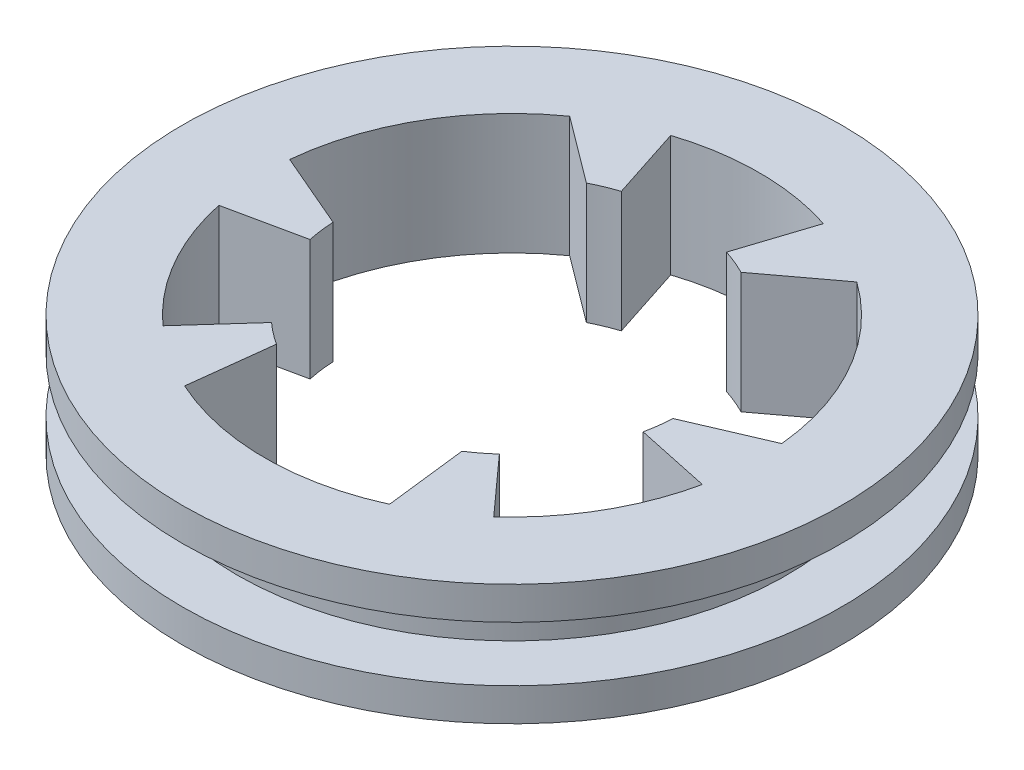
ISO-10303-21;
HEADER;
FILE_DESCRIPTION(('STEP AP214'),'2;1');
FILE_NAME('part.step','',(''),(''),'','','');
FILE_SCHEMA(('AUTOMOTIVE_DESIGN { 1 0 10303 214 1 1 1 1 }'));
ENDSEC;
DATA;
#1=APPLICATION_CONTEXT('core data for automotive mechanical design processes');
#2=APPLICATION_PROTOCOL_DEFINITION('international standard','automotive_design',2000,#1);
#3=PRODUCT_CONTEXT('',#1,'mechanical');
#4=PRODUCT('Part','Part','',(#3));
#5=PRODUCT_RELATED_PRODUCT_CATEGORY('part','',(#4));
#6=PRODUCT_DEFINITION_FORMATION('','',#4);
#7=PRODUCT_DEFINITION_CONTEXT('part definition',#1,'design');
#8=PRODUCT_DEFINITION('design','',#6,#7);
#9=PRODUCT_DEFINITION_SHAPE('','',#8);
#10=(LENGTH_UNIT() NAMED_UNIT(*) SI_UNIT(.MILLI.,.METRE.));
#11=(NAMED_UNIT(*) PLANE_ANGLE_UNIT() SI_UNIT($,.RADIAN.));
#12=(NAMED_UNIT(*) SI_UNIT($,.STERADIAN.) SOLID_ANGLE_UNIT());
#13=UNCERTAINTY_MEASURE_WITH_UNIT(LENGTH_MEASURE(1.E-05),#10,'distance_accuracy_value','');
#14=(GEOMETRIC_REPRESENTATION_CONTEXT(3) GLOBAL_UNCERTAINTY_ASSIGNED_CONTEXT((#13)) GLOBAL_UNIT_ASSIGNED_CONTEXT((#10,
#11,#12)) REPRESENTATION_CONTEXT('',''));
#15=CARTESIAN_POINT('',(0.,0.,0.));
#16=DIRECTION('',(0.,0.,1.));
#17=DIRECTION('',(1.,0.,0.));
#18=AXIS2_PLACEMENT_3D('',#15,#16,#17);
#19=CARTESIAN_POINT('',(-25.,2.5,0.));
#20=DIRECTION('',(0.,-1.,0.));
#21=DIRECTION('',(0.,0.,-1.));
#22=AXIS2_PLACEMENT_3D('',#19,#20,#21);
#23=PLANE('',#22);
#24=CARTESIAN_POINT('',(0.,2.5,0.));
#25=DIRECTION('',(0.,1.,0.));
#26=DIRECTION('',(0.,0.,1.));
#27=AXIS2_PLACEMENT_3D('',#24,#25,#26);
#28=CIRCLE('',#27,25.);
#29=CARTESIAN_POINT('',(0.,2.5,25.));
#30=VERTEX_POINT('',#29);
#31=EDGE_CURVE('E206',#30,#30,#28,.T.);
#32=ORIENTED_EDGE('',*,*,#31,.T.);
#33=EDGE_LOOP('',(#32));
#34=FACE_BOUND('',#33,.T.);
#35=CARTESIAN_POINT('',(0.,2.5,0.));
#36=DIRECTION('',(0.,1.,0.));
#37=DIRECTION('',(0.,0.,1.));
#38=AXIS2_PLACEMENT_3D('',#35,#36,#37);
#39=CIRCLE('',#38,30.);
#40=CARTESIAN_POINT('',(0.,2.5,30.));
#41=VERTEX_POINT('',#40);
#42=EDGE_CURVE('E11',#41,#41,#39,.T.);
#43=ORIENTED_EDGE('',*,*,#42,.F.);
#44=EDGE_LOOP('',(#43));
#45=FACE_BOUND('',#44,.T.);
#46=ADVANCED_FACE('F38',(#34,#45),#23,.T.);
#47=CARTESIAN_POINT('',(0.,19.9874111465534,0.));
#48=DIRECTION('',(0.,1.,0.));
#49=DIRECTION('',(0.,0.,1.));
#50=AXIS2_PLACEMENT_3D('',#47,#48,#49);
#51=CYLINDRICAL_SURFACE('',#50,30.);
#52=ORIENTED_EDGE('',*,*,#42,.T.);
#53=EDGE_LOOP('',(#52));
#54=FACE_BOUND('',#53,.T.);
#55=CARTESIAN_POINT('',(0.,5.5,0.));
#56=DIRECTION('',(0.,1.,0.));
#57=DIRECTION('',(0.,0.,1.));
#58=AXIS2_PLACEMENT_3D('',#55,#56,#57);
#59=CIRCLE('',#58,30.);
#60=CARTESIAN_POINT('',(0.,5.5,30.));
#61=VERTEX_POINT('',#60);
#62=EDGE_CURVE('E46',#61,#61,#59,.T.);
#63=ORIENTED_EDGE('',*,*,#62,.F.);
#64=EDGE_LOOP('',(#63));
#65=FACE_BOUND('',#64,.T.);
#66=ADVANCED_FACE('F391',(#54,#65),#51,.T.);
#67=CARTESIAN_POINT('',(-30.,5.5,0.));
#68=DIRECTION('',(0.,1.,0.));
#69=DIRECTION('',(0.,0.,1.));
#70=AXIS2_PLACEMENT_3D('',#67,#68,#69);
#71=PLANE('',#70);
#72=CARTESIAN_POINT('',(0.,5.5,0.));
#73=DIRECTION('',(0.,1.,0.));
#74=DIRECTION('',(0.,0.,1.));
#75=AXIS2_PLACEMENT_3D('',#72,#73,#74);
#76=CIRCLE('',#75,22.5);
#77=CARTESIAN_POINT('',(15.0554386430742,5.5,16.7207585732415));
#78=VERTEX_POINT('',#77);
#79=CARTESIAN_POINT('',(22.0083210165106,5.5,4.67801304339967));
#80=VERTEX_POINT('',#79);
#81=EDGE_CURVE('E53',#78,#80,#76,.T.);
#82=ORIENTED_EDGE('',*,*,#81,.F.);
#83=DIRECTION('',(-0.669130606358854,0.,-0.743144825477398));
#84=VECTOR('',#83,1.);
#85=CARTESIAN_POINT('',(0.,5.5,0.));
#86=LINE('',#85,#84);
#87=CARTESIAN_POINT('',(10.3715243985622,5.5,11.5187447948997));
#88=VERTEX_POINT('',#87);
#89=EDGE_CURVE('E213',#78,#88,#86,.T.);
#90=ORIENTED_EDGE('',*,*,#89,.T.);
#91=CARTESIAN_POINT('',(0.,5.5,0.));
#92=DIRECTION('',(0.,1.,0.));
#93=DIRECTION('',(0.,0.,1.));
#94=AXIS2_PLACEMENT_3D('',#91,#92,#93);
#95=CIRCLE('',#94,15.5);
#96=CARTESIAN_POINT('',(8.44097150806688,5.5,13.0000000000001));
#97=VERTEX_POINT('',#96);
#98=EDGE_CURVE('E237',#97,#88,#95,.T.);
#99=ORIENTED_EDGE('',*,*,#98,.F.);
#100=DIRECTION('',(0.117647058823515,0.,0.993055471537304));
#101=VECTOR('',#100,1.);
#102=CARTESIAN_POINT('',(6.8053507314174,5.5,-0.806228373702324));
#103=LINE('',#102,#101);
#104=CARTESIAN_POINT('',(9.32664330164017,5.5,20.4759303750518));
#105=VERTEX_POINT('',#104);
#106=EDGE_CURVE('E297',#97,#105,#103,.T.);
#107=ORIENTED_EDGE('',*,*,#106,.T.);
#108=CARTESIAN_POINT('',(0.,5.5,0.));
#109=DIRECTION('',(0.,1.,0.));
#110=DIRECTION('',(0.,0.,1.));
#111=AXIS2_PLACEMENT_3D('',#108,#109,#110);
#112=CIRCLE('',#111,22.5);
#113=CARTESIAN_POINT('',(-9.32664330164046,5.5,20.4759303750517));
#114=VERTEX_POINT('',#113);
#115=EDGE_CURVE('E293',#114,#105,#112,.T.);
#116=ORIENTED_EDGE('',*,*,#115,.F.);
#117=DIRECTION('',(-0.117647058823529,0.,0.993055471537302));
#118=VECTOR('',#117,1.);
#119=CARTESIAN_POINT('',(-6.80535073141739,5.5,-0.806228373702421));
#120=LINE('',#119,#118);
#121=CARTESIAN_POINT('',(-8.44097150806707,5.5,13.));
#122=VERTEX_POINT('',#121);
#123=EDGE_CURVE('E289',#122,#114,#120,.T.);
#124=ORIENTED_EDGE('',*,*,#123,.F.);
#125=CARTESIAN_POINT('',(-10.3715243985624,5.5,11.5187447948995));
#126=VERTEX_POINT('',#125);
#127=EDGE_CURVE('E288',#126,#122,#95,.T.);
#128=ORIENTED_EDGE('',*,*,#127,.F.);
#129=DIRECTION('',(0.669130606358865,0.,-0.743144825477388));
#130=VECTOR('',#129,1.);
#131=CARTESIAN_POINT('',(0.,5.5,0.));
#132=LINE('',#131,#130);
#133=CARTESIAN_POINT('',(-15.0554386430745,5.5,16.7207585732412));
#134=VERTEX_POINT('',#133);
#135=EDGE_CURVE('E284',#134,#126,#132,.T.);
#136=ORIENTED_EDGE('',*,*,#135,.F.);
#137=CARTESIAN_POINT('',(0.,5.5,0.));
#138=DIRECTION('',(0.,1.,0.));
#139=DIRECTION('',(0.,0.,1.));
#140=AXIS2_PLACEMENT_3D('',#137,#138,#139);
#141=CIRCLE('',#140,22.5);
#142=CARTESIAN_POINT('',(-22.0083210165107,5.5,4.67801304339936));
#143=VERTEX_POINT('',#142);
#144=EDGE_CURVE('E280',#143,#134,#141,.T.);
#145=ORIENTED_EDGE('',*,*,#144,.F.);
#146=DIRECTION('',(0.978147600733808,0.,-0.20791169081775));
#147=VECTOR('',#146,1.);
#148=CARTESIAN_POINT('',(0.,5.5,0.));
#149=LINE('',#148,#147);
#150=CARTESIAN_POINT('',(-15.161287811374,5.5,3.22263120767511));
#151=VERTEX_POINT('',#150);
#152=EDGE_CURVE('E276',#143,#151,#149,.T.);
#153=ORIENTED_EDGE('',*,*,#152,.T.);
#154=CARTESIAN_POINT('',(-15.4788160032312,5.5,0.810095758606647));
#155=VERTEX_POINT('',#154);
#156=EDGE_CURVE('E275',#155,#151,#95,.T.);
#157=ORIENTED_EDGE('',*,*,#156,.F.);
#158=DIRECTION('',(-0.918834795130201,0.,-0.394642394146957));
#159=VECTOR('',#158,1.);
#160=CARTESIAN_POINT('',(-2.70446111283062,5.5,6.29672080192167));
#161=LINE('',#160,#159);
#162=CARTESIAN_POINT('',(-22.3959975217364,5.5,-2.16085515626935));
#163=VERTEX_POINT('',#162);
#164=EDGE_CURVE('E271',#155,#163,#161,.T.);
#165=ORIENTED_EDGE('',*,*,#164,.T.);
#166=CARTESIAN_POINT('',(0.,5.5,0.));
#167=DIRECTION('',(0.,1.,0.));
#168=DIRECTION('',(0.,0.,1.));
#169=AXIS2_PLACEMENT_3D('',#166,#167,#168);
#170=CIRCLE('',#169,22.5);
#171=CARTESIAN_POINT('',(-13.0693542200959,5.5,-18.3150752187825));
#172=VERTEX_POINT('',#171);
#173=EDGE_CURVE('E267',#172,#163,#170,.T.);
#174=ORIENTED_EDGE('',*,*,#173,.F.);
#175=DIRECTION('',(-0.801187736306671,0.,-0.598413077390353));
#176=VECTOR('',#175,1.);
#177=CARTESIAN_POINT('',(4.10088961858683,5.5,-5.49049242821924));
#178=LINE('',#177,#176);
#179=CARTESIAN_POINT('',(-7.03784449516411,5.5,-13.8100957586068));
#180=VERTEX_POINT('',#179);
#181=EDGE_CURVE('E263',#180,#172,#178,.T.);
#182=ORIENTED_EDGE('',*,*,#181,.F.);
#183=CARTESIAN_POINT('',(-4.78976341281149,5.5,-14.7413760025749));
#184=VERTEX_POINT('',#183);
#185=EDGE_CURVE('E262',#184,#180,#95,.T.);
#186=ORIENTED_EDGE('',*,*,#185,.F.);
#187=DIRECTION('',(0.309016994374935,0.,0.951056516295158));
#188=VECTOR('',#187,1.);
#189=CARTESIAN_POINT('',(0.,5.5,0.));
#190=LINE('',#189,#188);
#191=CARTESIAN_POINT('',(-6.95288237343603,5.5,-21.398771616641));
#192=VERTEX_POINT('',#191);
#193=EDGE_CURVE('E258',#192,#184,#190,.T.);
#194=ORIENTED_EDGE('',*,*,#193,.F.);
#195=CARTESIAN_POINT('',(0.,5.5,0.));
#196=DIRECTION('',(0.,1.,0.));
#197=DIRECTION('',(0.,0.,1.));
#198=AXIS2_PLACEMENT_3D('',#195,#196,#197);
#199=CIRCLE('',#198,22.5);
#200=CARTESIAN_POINT('',(6.95288237343663,5.5,-21.3987716166409));
#201=VERTEX_POINT('',#200);
#202=EDGE_CURVE('E254',#201,#192,#199,.T.);
#203=ORIENTED_EDGE('',*,*,#202,.F.);
#204=DIRECTION('',(-0.309016994374961,0.,0.951056516295149));
#205=VECTOR('',#204,1.);
#206=CARTESIAN_POINT('',(0.,5.5,0.));
#207=LINE('',#206,#205);
#208=CARTESIAN_POINT('',(4.78976341281191,5.5,-14.7413760025748));
#209=VERTEX_POINT('',#208);
#210=EDGE_CURVE('E250',#201,#209,#207,.T.);
#211=ORIENTED_EDGE('',*,*,#210,.T.);
#212=CARTESIAN_POINT('',(7.0378444951643,5.5,-13.8100957586067));
#213=VERTEX_POINT('',#212);
#214=EDGE_CURVE('E238',#213,#209,#95,.T.);
#215=ORIENTED_EDGE('',*,*,#214,.F.);
#216=DIRECTION('',(0.801187736306679,0.,-0.598413077390342));
#217=VECTOR('',#216,1.);
#218=CARTESIAN_POINT('',(-4.10088961858676,5.5,-5.49049242821931));
#219=LINE('',#218,#217);
#220=CARTESIAN_POINT('',(13.0693542200962,5.5,-18.3150752187823));
#221=VERTEX_POINT('',#220);
#222=EDGE_CURVE('E246',#213,#221,#219,.T.);
#223=ORIENTED_EDGE('',*,*,#222,.T.);
#224=CARTESIAN_POINT('',(0.,5.5,0.));
#225=DIRECTION('',(0.,1.,0.));
#226=DIRECTION('',(0.,0.,1.));
#227=AXIS2_PLACEMENT_3D('',#224,#225,#226);
#228=CIRCLE('',#227,22.5);
#229=CARTESIAN_POINT('',(22.3959975217365,5.5,-2.16085515626904));
#230=VERTEX_POINT('',#229);
#231=EDGE_CURVE('E242',#230,#221,#228,.T.);
#232=ORIENTED_EDGE('',*,*,#231,.F.);
#233=DIRECTION('',(0.918834795130206,0.,-0.394642394146944));
#234=VECTOR('',#233,1.);
#235=CARTESIAN_POINT('',(2.70446111283053,5.5,6.29672080192171));
#236=LINE('',#235,#234);
#237=CARTESIAN_POINT('',(15.4788160032312,5.5,0.810095758606862));
#238=VERTEX_POINT('',#237);
#239=EDGE_CURVE('E236',#238,#230,#236,.T.);
#240=ORIENTED_EDGE('',*,*,#239,.F.);
#241=CARTESIAN_POINT('',(15.161287811374,5.5,3.22263120767533));
#242=VERTEX_POINT('',#241);
#243=EDGE_CURVE('E232',#242,#238,#95,.T.);
#244=ORIENTED_EDGE('',*,*,#243,.F.);
#245=DIRECTION('',(-0.978147600733805,0.,-0.207911690817763));
#246=VECTOR('',#245,1.);
#247=CARTESIAN_POINT('',(0.,5.5,0.));
#248=LINE('',#247,#246);
#249=EDGE_CURVE('E224',#80,#242,#248,.T.);
#250=ORIENTED_EDGE('',*,*,#249,.F.);
#251=EDGE_LOOP('',(#82,#90,#99,#107,#116,#124,#128,#136,#145,#153,#157,#165,#174,#182,#186,#194,
#203,#211,#215,#223,#232,#240,#244,#250));
#252=FACE_BOUND('',#251,.T.);
#253=ORIENTED_EDGE('',*,*,#62,.T.);
#254=EDGE_LOOP('',(#253));
#255=FACE_BOUND('',#254,.T.);
#256=ADVANCED_FACE('F389',(#252,#255),#71,.T.);
#257=CARTESIAN_POINT('',(-30.,-5.5,0.));
#258=DIRECTION('',(0.,-1.,0.));
#259=DIRECTION('',(0.,0.,-1.));
#260=AXIS2_PLACEMENT_3D('',#257,#258,#259);
#261=PLANE('',#260);
#262=CARTESIAN_POINT('',(0.,-5.5,0.));
#263=DIRECTION('',(0.,-1.,0.));
#264=DIRECTION('',(0.,0.,-1.));
#265=AXIS2_PLACEMENT_3D('',#262,#263,#264);
#266=CIRCLE('',#265,22.5);
#267=CARTESIAN_POINT('',(15.0554386430742,-5.5,16.7207585732415));
#268=VERTEX_POINT('',#267);
#269=CARTESIAN_POINT('',(22.0083210165106,-5.5,4.67801304339967));
#270=VERTEX_POINT('',#269);
#271=EDGE_CURVE('E210',#268,#270,#266,.F.);
#272=ORIENTED_EDGE('',*,*,#271,.T.);
#273=DIRECTION('',(-0.978147600733805,0.,-0.207911690817763));
#274=VECTOR('',#273,1.);
#275=CARTESIAN_POINT('',(0.,-5.5,0.));
#276=LINE('',#275,#274);
#277=CARTESIAN_POINT('',(15.161287811374,-5.5,3.22263120767533));
#278=VERTEX_POINT('',#277);
#279=EDGE_CURVE('E198',#270,#278,#276,.T.);
#280=ORIENTED_EDGE('',*,*,#279,.T.);
#281=CARTESIAN_POINT('',(0.,-5.5,0.));
#282=DIRECTION('',(0.,-1.,0.));
#283=DIRECTION('',(0.,0.,-1.));
#284=AXIS2_PLACEMENT_3D('',#281,#282,#283);
#285=CIRCLE('',#284,15.5);
#286=CARTESIAN_POINT('',(15.4788160032312,-5.5,0.810095758606862));
#287=VERTEX_POINT('',#286);
#288=EDGE_CURVE('E574',#278,#287,#285,.F.);
#289=ORIENTED_EDGE('',*,*,#288,.T.);
#290=DIRECTION('',(0.918834795130206,0.,-0.394642394146944));
#291=VECTOR('',#290,1.);
#292=CARTESIAN_POINT('',(2.70446111283053,-5.5,6.29672080192171));
#293=LINE('',#292,#291);
#294=CARTESIAN_POINT('',(22.3959975217365,-5.5,-2.16085515626904));
#295=VERTEX_POINT('',#294);
#296=EDGE_CURVE('E570',#287,#295,#293,.T.);
#297=ORIENTED_EDGE('',*,*,#296,.T.);
#298=CARTESIAN_POINT('',(0.,-5.5,0.));
#299=DIRECTION('',(0.,-1.,0.));
#300=DIRECTION('',(0.,0.,-1.));
#301=AXIS2_PLACEMENT_3D('',#298,#299,#300);
#302=CIRCLE('',#301,22.5);
#303=CARTESIAN_POINT('',(13.0693542200961,-5.5,-18.3150752187823));
#304=VERTEX_POINT('',#303);
#305=EDGE_CURVE('E566',#295,#304,#302,.F.);
#306=ORIENTED_EDGE('',*,*,#305,.T.);
#307=DIRECTION('',(0.801187736306679,0.,-0.598413077390342));
#308=VECTOR('',#307,1.);
#309=CARTESIAN_POINT('',(-4.10088961858676,-5.5,-5.49049242821931));
#310=LINE('',#309,#308);
#311=CARTESIAN_POINT('',(7.0378444951643,-5.5,-13.8100957586067));
#312=VERTEX_POINT('',#311);
#313=EDGE_CURVE('E563',#312,#304,#310,.T.);
#314=ORIENTED_EDGE('',*,*,#313,.F.);
#315=CARTESIAN_POINT('',(0.,-5.5,0.));
#316=DIRECTION('',(0.,-1.,0.));
#317=DIRECTION('',(0.,0.,-1.));
#318=AXIS2_PLACEMENT_3D('',#315,#316,#317);
#319=CIRCLE('',#318,15.5);
#320=CARTESIAN_POINT('',(4.78976341281191,-5.5,-14.7413760025748));
#321=VERTEX_POINT('',#320);
#322=EDGE_CURVE('E559',#312,#321,#319,.F.);
#323=ORIENTED_EDGE('',*,*,#322,.T.);
#324=DIRECTION('',(-0.309016994374961,0.,0.951056516295149));
#325=VECTOR('',#324,1.);
#326=CARTESIAN_POINT('',(0.,-5.5,0.));
#327=LINE('',#326,#325);
#328=CARTESIAN_POINT('',(6.95288237343663,-5.5,-21.3987716166409));
#329=VERTEX_POINT('',#328);
#330=EDGE_CURVE('E556',#329,#321,#327,.T.);
#331=ORIENTED_EDGE('',*,*,#330,.F.);
#332=CARTESIAN_POINT('',(0.,-5.5,0.));
#333=DIRECTION('',(0.,-1.,0.));
#334=DIRECTION('',(0.,0.,-1.));
#335=AXIS2_PLACEMENT_3D('',#332,#333,#334);
#336=CIRCLE('',#335,22.5);
#337=CARTESIAN_POINT('',(-6.95288237343603,-5.5,-21.3987716166411));
#338=VERTEX_POINT('',#337);
#339=EDGE_CURVE('E552',#329,#338,#336,.F.);
#340=ORIENTED_EDGE('',*,*,#339,.T.);
#341=DIRECTION('',(0.309016994374935,0.,0.951056516295158));
#342=VECTOR('',#341,1.);
#343=CARTESIAN_POINT('',(0.,-5.5,0.));
#344=LINE('',#343,#342);
#345=CARTESIAN_POINT('',(-4.78976341281149,-5.5,-14.7413760025749));
#346=VERTEX_POINT('',#345);
#347=EDGE_CURVE('E548',#338,#346,#344,.T.);
#348=ORIENTED_EDGE('',*,*,#347,.T.);
#349=CARTESIAN_POINT('',(0.,-5.5,0.));
#350=DIRECTION('',(0.,-1.,0.));
#351=DIRECTION('',(0.,0.,-1.));
#352=AXIS2_PLACEMENT_3D('',#349,#350,#351);
#353=CIRCLE('',#352,15.5);
#354=CARTESIAN_POINT('',(-7.03784449516411,-5.5,-13.8100957586068));
#355=VERTEX_POINT('',#354);
#356=EDGE_CURVE('E544',#346,#355,#353,.F.);
#357=ORIENTED_EDGE('',*,*,#356,.T.);
#358=DIRECTION('',(-0.801187736306671,0.,-0.598413077390353));
#359=VECTOR('',#358,1.);
#360=CARTESIAN_POINT('',(4.10088961858683,-5.5,-5.49049242821924));
#361=LINE('',#360,#359);
#362=CARTESIAN_POINT('',(-13.0693542200959,-5.5,-18.3150752187825));
#363=VERTEX_POINT('',#362);
#364=EDGE_CURVE('E540',#355,#363,#361,.T.);
#365=ORIENTED_EDGE('',*,*,#364,.T.);
#366=CARTESIAN_POINT('',(0.,-5.5,0.));
#367=DIRECTION('',(0.,-1.,0.));
#368=DIRECTION('',(0.,0.,-1.));
#369=AXIS2_PLACEMENT_3D('',#366,#367,#368);
#370=CIRCLE('',#369,22.5);
#371=CARTESIAN_POINT('',(-22.3959975217364,-5.5,-2.16085515626935));
#372=VERTEX_POINT('',#371);
#373=EDGE_CURVE('E536',#363,#372,#370,.F.);
#374=ORIENTED_EDGE('',*,*,#373,.T.);
#375=DIRECTION('',(-0.918834795130201,0.,-0.394642394146957));
#376=VECTOR('',#375,1.);
#377=CARTESIAN_POINT('',(-2.70446111283062,-5.5,6.29672080192167));
#378=LINE('',#377,#376);
#379=CARTESIAN_POINT('',(-15.4788160032312,-5.5,0.810095758606648));
#380=VERTEX_POINT('',#379);
#381=EDGE_CURVE('E533',#380,#372,#378,.T.);
#382=ORIENTED_EDGE('',*,*,#381,.F.);
#383=CARTESIAN_POINT('',(0.,-5.5,0.));
#384=DIRECTION('',(0.,-1.,0.));
#385=DIRECTION('',(0.,0.,-1.));
#386=AXIS2_PLACEMENT_3D('',#383,#384,#385);
#387=CIRCLE('',#386,15.5);
#388=CARTESIAN_POINT('',(-15.161287811374,-5.5,3.22263120767511));
#389=VERTEX_POINT('',#388);
#390=EDGE_CURVE('E529',#380,#389,#387,.F.);
#391=ORIENTED_EDGE('',*,*,#390,.T.);
#392=DIRECTION('',(0.978147600733808,0.,-0.20791169081775));
#393=VECTOR('',#392,1.);
#394=CARTESIAN_POINT('',(0.,-5.5,0.));
#395=LINE('',#394,#393);
#396=CARTESIAN_POINT('',(-22.0083210165107,-5.5,4.67801304339936));
#397=VERTEX_POINT('',#396);
#398=EDGE_CURVE('E526',#397,#389,#395,.T.);
#399=ORIENTED_EDGE('',*,*,#398,.F.);
#400=CARTESIAN_POINT('',(0.,-5.5,0.));
#401=DIRECTION('',(0.,-1.,0.));
#402=DIRECTION('',(0.,0.,-1.));
#403=AXIS2_PLACEMENT_3D('',#400,#401,#402);
#404=CIRCLE('',#403,22.5);
#405=CARTESIAN_POINT('',(-15.0554386430745,-5.5,16.7207585732412));
#406=VERTEX_POINT('',#405);
#407=EDGE_CURVE('E522',#397,#406,#404,.F.);
#408=ORIENTED_EDGE('',*,*,#407,.T.);
#409=DIRECTION('',(0.669130606358865,0.,-0.743144825477388));
#410=VECTOR('',#409,1.);
#411=CARTESIAN_POINT('',(0.,-5.5,0.));
#412=LINE('',#411,#410);
#413=CARTESIAN_POINT('',(-10.3715243985624,-5.5,11.5187447948995));
#414=VERTEX_POINT('',#413);
#415=EDGE_CURVE('E518',#406,#414,#412,.T.);
#416=ORIENTED_EDGE('',*,*,#415,.T.);
#417=CARTESIAN_POINT('',(0.,-5.5,0.));
#418=DIRECTION('',(0.,-1.,0.));
#419=DIRECTION('',(0.,0.,-1.));
#420=AXIS2_PLACEMENT_3D('',#417,#418,#419);
#421=CIRCLE('',#420,15.5);
#422=CARTESIAN_POINT('',(-8.44097150806707,-5.5,13.));
#423=VERTEX_POINT('',#422);
#424=EDGE_CURVE('E514',#414,#423,#421,.F.);
#425=ORIENTED_EDGE('',*,*,#424,.T.);
#426=DIRECTION('',(-0.117647058823529,0.,0.993055471537302));
#427=VECTOR('',#426,1.);
#428=CARTESIAN_POINT('',(-6.80535073141739,-5.5,-0.806228373702421));
#429=LINE('',#428,#427);
#430=CARTESIAN_POINT('',(-9.32664330164046,-5.5,20.4759303750517));
#431=VERTEX_POINT('',#430);
#432=EDGE_CURVE('E510',#423,#431,#429,.T.);
#433=ORIENTED_EDGE('',*,*,#432,.T.);
#434=CARTESIAN_POINT('',(0.,-5.5,0.));
#435=DIRECTION('',(0.,-1.,0.));
#436=DIRECTION('',(0.,0.,-1.));
#437=AXIS2_PLACEMENT_3D('',#434,#435,#436);
#438=CIRCLE('',#437,22.5);
#439=CARTESIAN_POINT('',(9.32664330164017,-5.5,20.4759303750518));
#440=VERTEX_POINT('',#439);
#441=EDGE_CURVE('E505',#431,#440,#438,.F.);
#442=ORIENTED_EDGE('',*,*,#441,.T.);
#443=DIRECTION('',(0.117647058823515,0.,0.993055471537304));
#444=VECTOR('',#443,1.);
#445=CARTESIAN_POINT('',(6.8053507314174,-5.5,-0.806228373702324));
#446=LINE('',#445,#444);
#447=CARTESIAN_POINT('',(8.44097150806688,-5.5,13.0000000000001));
#448=VERTEX_POINT('',#447);
#449=EDGE_CURVE('E502',#448,#440,#446,.T.);
#450=ORIENTED_EDGE('',*,*,#449,.F.);
#451=CARTESIAN_POINT('',(0.,-5.5,0.));
#452=DIRECTION('',(0.,-1.,0.));
#453=DIRECTION('',(0.,0.,-1.));
#454=AXIS2_PLACEMENT_3D('',#451,#452,#453);
#455=CIRCLE('',#454,15.5);
#456=CARTESIAN_POINT('',(10.3715243985622,-5.5,11.5187447948997));
#457=VERTEX_POINT('',#456);
#458=EDGE_CURVE('E226',#448,#457,#455,.F.);
#459=ORIENTED_EDGE('',*,*,#458,.T.);
#460=DIRECTION('',(-0.669130606358854,0.,-0.743144825477398));
#461=VECTOR('',#460,1.);
#462=CARTESIAN_POINT('',(0.,-5.5,0.));
#463=LINE('',#462,#461);
#464=EDGE_CURVE('E219',#268,#457,#463,.T.);
#465=ORIENTED_EDGE('',*,*,#464,.F.);
#466=EDGE_LOOP('',(#272,#280,#289,#297,#306,#314,#323,#331,#340,#348,#357,#365,#374,#382,#391,
#399,#408,#416,#425,#433,#442,#450,#459,#465));
#467=FACE_BOUND('',#466,.T.);
#468=CARTESIAN_POINT('',(0.,-5.5,0.));
#469=DIRECTION('',(0.,1.,0.));
#470=DIRECTION('',(0.,0.,1.));
#471=AXIS2_PLACEMENT_3D('',#468,#469,#470);
#472=CIRCLE('',#471,30.);
#473=CARTESIAN_POINT('',(0.,-5.5,30.));
#474=VERTEX_POINT('',#473);
#475=EDGE_CURVE('E382',#474,#474,#472,.T.);
#476=ORIENTED_EDGE('',*,*,#475,.F.);
#477=EDGE_LOOP('',(#476));
#478=FACE_BOUND('',#477,.T.);
#479=ADVANCED_FACE('F216',(#467,#478),#261,.T.);
#480=CARTESIAN_POINT('',(0.,19.9874111465534,0.));
#481=DIRECTION('',(0.,1.,0.));
#482=DIRECTION('',(0.,0.,1.));
#483=AXIS2_PLACEMENT_3D('',#480,#481,#482);
#484=CYLINDRICAL_SURFACE('',#483,30.);
#485=ORIENTED_EDGE('',*,*,#475,.T.);
#486=EDGE_LOOP('',(#485));
#487=FACE_BOUND('',#486,.T.);
#488=CARTESIAN_POINT('',(0.,-2.5,0.));
#489=DIRECTION('',(0.,1.,0.));
#490=DIRECTION('',(0.,0.,1.));
#491=AXIS2_PLACEMENT_3D('',#488,#489,#490);
#492=CIRCLE('',#491,30.);
#493=CARTESIAN_POINT('',(0.,-2.5,30.));
#494=VERTEX_POINT('',#493);
#495=EDGE_CURVE('E378',#494,#494,#492,.T.);
#496=ORIENTED_EDGE('',*,*,#495,.F.);
#497=EDGE_LOOP('',(#496));
#498=FACE_BOUND('',#497,.T.);
#499=ADVANCED_FACE('F405',(#487,#498),#484,.T.);
#500=CARTESIAN_POINT('',(-25.,-2.5,0.));
#501=DIRECTION('',(0.,1.,0.));
#502=DIRECTION('',(0.,0.,1.));
#503=AXIS2_PLACEMENT_3D('',#500,#501,#502);
#504=PLANE('',#503);
#505=ORIENTED_EDGE('',*,*,#495,.T.);
#506=EDGE_LOOP('',(#505));
#507=FACE_BOUND('',#506,.T.);
#508=CARTESIAN_POINT('',(0.,-2.5,0.));
#509=DIRECTION('',(0.,1.,0.));
#510=DIRECTION('',(0.,0.,1.));
#511=AXIS2_PLACEMENT_3D('',#508,#509,#510);
#512=CIRCLE('',#511,25.);
#513=CARTESIAN_POINT('',(0.,-2.5,25.));
#514=VERTEX_POINT('',#513);
#515=EDGE_CURVE('E374',#514,#514,#512,.T.);
#516=ORIENTED_EDGE('',*,*,#515,.F.);
#517=EDGE_LOOP('',(#516));
#518=FACE_BOUND('',#517,.T.);
#519=ADVANCED_FACE('F408',(#507,#518),#504,.T.);
#520=CARTESIAN_POINT('',(0.,19.9874111465534,0.));
#521=DIRECTION('',(0.,1.,0.));
#522=DIRECTION('',(0.,0.,1.));
#523=AXIS2_PLACEMENT_3D('',#520,#521,#522);
#524=CYLINDRICAL_SURFACE('',#523,25.);
#525=ORIENTED_EDGE('',*,*,#515,.T.);
#526=EDGE_LOOP('',(#525));
#527=FACE_BOUND('',#526,.T.);
#528=ORIENTED_EDGE('',*,*,#31,.F.);
#529=EDGE_LOOP('',(#528));
#530=FACE_BOUND('',#529,.T.);
#531=ADVANCED_FACE('F412',(#527,#530),#524,.T.);
#532=CARTESIAN_POINT('',(0.,-5.501,0.));
#533=DIRECTION('',(0.,1.,0.));
#534=DIRECTION('',(0.,0.,1.));
#535=AXIS2_PLACEMENT_3D('',#532,#533,#534);
#536=CYLINDRICAL_SURFACE('',#535,22.5);
#537=DIRECTION('',(0.,1.,0.));
#538=VECTOR('',#537,1.);
#539=CARTESIAN_POINT('',(15.0554386430742,-5.501,16.7207585732415));
#540=LINE('',#539,#538);
#541=EDGE_CURVE('E207',#268,#78,#540,.T.);
#542=ORIENTED_EDGE('',*,*,#541,.T.);
#543=ORIENTED_EDGE('',*,*,#81,.T.);
#544=DIRECTION('',(0.,1.,0.));
#545=VECTOR('',#544,1.);
#546=CARTESIAN_POINT('',(22.0083210165106,-5.501,4.67801304339967));
#547=LINE('',#546,#545);
#548=EDGE_CURVE('E200',#270,#80,#547,.T.);
#549=ORIENTED_EDGE('',*,*,#548,.F.);
#550=ORIENTED_EDGE('',*,*,#271,.F.);
#551=EDGE_LOOP('',(#542,#543,#549,#550));
#552=FACE_BOUND('',#551,.T.);
#553=ADVANCED_FACE('F209',(#552),#536,.F.);
#554=CARTESIAN_POINT('',(0.,-5.501,0.));
#555=DIRECTION('',(0.743144825477398,0.,-0.669130606358854));
#556=DIRECTION('',(-0.669130606358854,0.,-0.743144825477398));
#557=AXIS2_PLACEMENT_3D('',#554,#555,#556);
#558=PLANE('',#557);
#559=ORIENTED_EDGE('',*,*,#464,.T.);
#560=DIRECTION('',(0.,1.,0.));
#561=VECTOR('',#560,1.);
#562=CARTESIAN_POINT('',(10.3715243985622,-5.501,11.5187447948997));
#563=LINE('',#562,#561);
#564=EDGE_CURVE('E306',#457,#88,#563,.T.);
#565=ORIENTED_EDGE('',*,*,#564,.T.);
#566=ORIENTED_EDGE('',*,*,#89,.F.);
#567=ORIENTED_EDGE('',*,*,#541,.F.);
#568=EDGE_LOOP('',(#559,#565,#566,#567));
#569=FACE_BOUND('',#568,.T.);
#570=ADVANCED_FACE('F419',(#569),#558,.T.);
#571=CARTESIAN_POINT('',(0.,-5.501,0.));
#572=DIRECTION('',(0.,1.,0.));
#573=DIRECTION('',(0.,0.,1.));
#574=AXIS2_PLACEMENT_3D('',#571,#572,#573);
#575=CYLINDRICAL_SURFACE('',#574,15.5);
#576=DIRECTION('',(0.,1.,0.));
#577=VECTOR('',#576,1.);
#578=CARTESIAN_POINT('',(8.44097150806688,-5.501,13.0000000000001));
#579=LINE('',#578,#577);
#580=EDGE_CURVE('E309',#448,#97,#579,.T.);
#581=ORIENTED_EDGE('',*,*,#580,.T.);
#582=ORIENTED_EDGE('',*,*,#98,.T.);
#583=ORIENTED_EDGE('',*,*,#564,.F.);
#584=ORIENTED_EDGE('',*,*,#458,.F.);
#585=EDGE_LOOP('',(#581,#582,#583,#584));
#586=FACE_BOUND('',#585,.T.);
#587=ADVANCED_FACE('F486',(#586),#575,.F.);
#588=CARTESIAN_POINT('',(6.8053507314174,-5.501,-0.806228373702324));
#589=DIRECTION('',(-0.993055471537303,0.,0.117647058823515));
#590=DIRECTION('',(0.117647058823515,0.,0.993055471537304));
#591=AXIS2_PLACEMENT_3D('',#588,#589,#590);
#592=PLANE('',#591);
#593=ORIENTED_EDGE('',*,*,#449,.T.);
#594=DIRECTION('',(0.,1.,0.));
#595=VECTOR('',#594,1.);
#596=CARTESIAN_POINT('',(9.32664330164017,-5.501,20.4759303750518));
#597=LINE('',#596,#595);
#598=EDGE_CURVE('E312',#440,#105,#597,.T.);
#599=ORIENTED_EDGE('',*,*,#598,.T.);
#600=ORIENTED_EDGE('',*,*,#106,.F.);
#601=ORIENTED_EDGE('',*,*,#580,.F.);
#602=EDGE_LOOP('',(#593,#599,#600,#601));
#603=FACE_BOUND('',#602,.T.);
#604=ADVANCED_FACE('F482',(#603),#592,.T.);
#605=CARTESIAN_POINT('',(0.,-5.501,0.));
#606=DIRECTION('',(0.,1.,0.));
#607=DIRECTION('',(0.,0.,1.));
#608=AXIS2_PLACEMENT_3D('',#605,#606,#607);
#609=CYLINDRICAL_SURFACE('',#608,22.5);
#610=DIRECTION('',(0.,1.,0.));
#611=VECTOR('',#610,1.);
#612=CARTESIAN_POINT('',(-9.32664330164046,-5.501,20.4759303750517));
#613=LINE('',#612,#611);
#614=EDGE_CURVE('E315',#431,#114,#613,.T.);
#615=ORIENTED_EDGE('',*,*,#614,.T.);
#616=ORIENTED_EDGE('',*,*,#115,.T.);
#617=ORIENTED_EDGE('',*,*,#598,.F.);
#618=ORIENTED_EDGE('',*,*,#441,.F.);
#619=EDGE_LOOP('',(#615,#616,#617,#618));
#620=FACE_BOUND('',#619,.T.);
#621=ADVANCED_FACE('F478',(#620),#609,.F.);
#622=CARTESIAN_POINT('',(-6.80535073141739,-5.501,-0.806228373702421));
#623=DIRECTION('',(-0.993055471537302,0.,-0.117647058823529));
#624=DIRECTION('',(-0.117647058823529,0.,0.993055471537302));
#625=AXIS2_PLACEMENT_3D('',#622,#623,#624);
#626=PLANE('',#625);
#627=DIRECTION('',(0.,1.,0.));
#628=VECTOR('',#627,1.);
#629=CARTESIAN_POINT('',(-8.44097150806707,-5.501,13.));
#630=LINE('',#629,#628);
#631=EDGE_CURVE('E318',#423,#122,#630,.T.);
#632=ORIENTED_EDGE('',*,*,#631,.T.);
#633=ORIENTED_EDGE('',*,*,#123,.T.);
#634=ORIENTED_EDGE('',*,*,#614,.F.);
#635=ORIENTED_EDGE('',*,*,#432,.F.);
#636=EDGE_LOOP('',(#632,#633,#634,#635));
#637=FACE_BOUND('',#636,.T.);
#638=ADVANCED_FACE('F475',(#637),#626,.F.);
#639=DIRECTION('',(0.,1.,0.));
#640=VECTOR('',#639,1.);
#641=CARTESIAN_POINT('',(-10.3715243985624,-5.501,11.5187447948995));
#642=LINE('',#641,#640);
#643=EDGE_CURVE('E321',#414,#126,#642,.T.);
#644=ORIENTED_EDGE('',*,*,#643,.T.);
#645=ORIENTED_EDGE('',*,*,#127,.T.);
#646=ORIENTED_EDGE('',*,*,#631,.F.);
#647=ORIENTED_EDGE('',*,*,#424,.F.);
#648=EDGE_LOOP('',(#644,#645,#646,#647));
#649=FACE_BOUND('',#648,.T.);
#650=ADVANCED_FACE('F473',(#649),#575,.F.);
#651=CARTESIAN_POINT('',(0.,-5.501,0.));
#652=DIRECTION('',(0.743144825477388,0.,0.669130606358865));
#653=DIRECTION('',(0.669130606358865,0.,-0.743144825477388));
#654=AXIS2_PLACEMENT_3D('',#651,#652,#653);
#655=PLANE('',#654);
#656=DIRECTION('',(0.,1.,0.));
#657=VECTOR('',#656,1.);
#658=CARTESIAN_POINT('',(-15.0554386430745,-5.501,16.7207585732412));
#659=LINE('',#658,#657);
#660=EDGE_CURVE('E324',#406,#134,#659,.T.);
#661=ORIENTED_EDGE('',*,*,#660,.T.);
#662=ORIENTED_EDGE('',*,*,#135,.T.);
#663=ORIENTED_EDGE('',*,*,#643,.F.);
#664=ORIENTED_EDGE('',*,*,#415,.F.);
#665=EDGE_LOOP('',(#661,#662,#663,#664));
#666=FACE_BOUND('',#665,.T.);
#667=ADVANCED_FACE('F469',(#666),#655,.F.);
#668=CARTESIAN_POINT('',(0.,-5.501,0.));
#669=DIRECTION('',(0.,1.,0.));
#670=DIRECTION('',(0.,0.,1.));
#671=AXIS2_PLACEMENT_3D('',#668,#669,#670);
#672=CYLINDRICAL_SURFACE('',#671,22.5);
#673=DIRECTION('',(0.,1.,0.));
#674=VECTOR('',#673,1.);
#675=CARTESIAN_POINT('',(-22.0083210165107,-5.501,4.67801304339936));
#676=LINE('',#675,#674);
#677=EDGE_CURVE('E327',#397,#143,#676,.T.);
#678=ORIENTED_EDGE('',*,*,#677,.T.);
#679=ORIENTED_EDGE('',*,*,#144,.T.);
#680=ORIENTED_EDGE('',*,*,#660,.F.);
#681=ORIENTED_EDGE('',*,*,#407,.F.);
#682=EDGE_LOOP('',(#678,#679,#680,#681));
#683=FACE_BOUND('',#682,.T.);
#684=ADVANCED_FACE('F465',(#683),#672,.F.);
#685=CARTESIAN_POINT('',(0.,-5.501,0.));
#686=DIRECTION('',(0.20791169081775,0.,0.978147600733808));
#687=DIRECTION('',(0.978147600733808,0.,-0.20791169081775));
#688=AXIS2_PLACEMENT_3D('',#685,#686,#687);
#689=PLANE('',#688);
#690=ORIENTED_EDGE('',*,*,#398,.T.);
#691=DIRECTION('',(0.,1.,0.));
#692=VECTOR('',#691,1.);
#693=CARTESIAN_POINT('',(-15.161287811374,-5.501,3.22263120767511));
#694=LINE('',#693,#692);
#695=EDGE_CURVE('E330',#389,#151,#694,.T.);
#696=ORIENTED_EDGE('',*,*,#695,.T.);
#697=ORIENTED_EDGE('',*,*,#152,.F.);
#698=ORIENTED_EDGE('',*,*,#677,.F.);
#699=EDGE_LOOP('',(#690,#696,#697,#698));
#700=FACE_BOUND('',#699,.T.);
#701=ADVANCED_FACE('F462',(#700),#689,.T.);
#702=DIRECTION('',(0.,1.,0.));
#703=VECTOR('',#702,1.);
#704=CARTESIAN_POINT('',(-15.4788160032312,-5.501,0.810095758606647));
#705=LINE('',#704,#703);
#706=EDGE_CURVE('E333',#380,#155,#705,.T.);
#707=ORIENTED_EDGE('',*,*,#706,.T.);
#708=ORIENTED_EDGE('',*,*,#156,.T.);
#709=ORIENTED_EDGE('',*,*,#695,.F.);
#710=ORIENTED_EDGE('',*,*,#390,.F.);
#711=EDGE_LOOP('',(#707,#708,#709,#710));
#712=FACE_BOUND('',#711,.T.);
#713=ADVANCED_FACE('F460',(#712),#575,.F.);
#714=CARTESIAN_POINT('',(-2.70446111283062,-5.501,6.29672080192167));
#715=DIRECTION('',(0.394642394146957,0.,-0.918834795130201));
#716=DIRECTION('',(-0.918834795130201,0.,-0.394642394146957));
#717=AXIS2_PLACEMENT_3D('',#714,#715,#716);
#718=PLANE('',#717);
#719=ORIENTED_EDGE('',*,*,#381,.T.);
#720=DIRECTION('',(0.,1.,0.));
#721=VECTOR('',#720,1.);
#722=CARTESIAN_POINT('',(-22.3959975217364,-5.501,-2.16085515626935));
#723=LINE('',#722,#721);
#724=EDGE_CURVE('E336',#372,#163,#723,.T.);
#725=ORIENTED_EDGE('',*,*,#724,.T.);
#726=ORIENTED_EDGE('',*,*,#164,.F.);
#727=ORIENTED_EDGE('',*,*,#706,.F.);
#728=EDGE_LOOP('',(#719,#725,#726,#727));
#729=FACE_BOUND('',#728,.T.);
#730=ADVANCED_FACE('F456',(#729),#718,.T.);
#731=CARTESIAN_POINT('',(0.,-5.501,0.));
#732=DIRECTION('',(0.,1.,0.));
#733=DIRECTION('',(0.,0.,1.));
#734=AXIS2_PLACEMENT_3D('',#731,#732,#733);
#735=CYLINDRICAL_SURFACE('',#734,22.5);
#736=DIRECTION('',(0.,1.,0.));
#737=VECTOR('',#736,1.);
#738=CARTESIAN_POINT('',(-13.0693542200959,-5.501,-18.3150752187825));
#739=LINE('',#738,#737);
#740=EDGE_CURVE('E339',#363,#172,#739,.T.);
#741=ORIENTED_EDGE('',*,*,#740,.T.);
#742=ORIENTED_EDGE('',*,*,#173,.T.);
#743=ORIENTED_EDGE('',*,*,#724,.F.);
#744=ORIENTED_EDGE('',*,*,#373,.F.);
#745=EDGE_LOOP('',(#741,#742,#743,#744));
#746=FACE_BOUND('',#745,.T.);
#747=ADVANCED_FACE('F452',(#746),#735,.F.);
#748=CARTESIAN_POINT('',(4.10088961858683,-5.501,-5.49049242821924));
#749=DIRECTION('',(0.598413077390353,0.,-0.801187736306671));
#750=DIRECTION('',(-0.801187736306671,0.,-0.598413077390353));
#751=AXIS2_PLACEMENT_3D('',#748,#749,#750);
#752=PLANE('',#751);
#753=DIRECTION('',(0.,1.,0.));
#754=VECTOR('',#753,1.);
#755=CARTESIAN_POINT('',(-7.03784449516411,-5.501,-13.8100957586068));
#756=LINE('',#755,#754);
#757=EDGE_CURVE('E342',#355,#180,#756,.T.);
#758=ORIENTED_EDGE('',*,*,#757,.T.);
#759=ORIENTED_EDGE('',*,*,#181,.T.);
#760=ORIENTED_EDGE('',*,*,#740,.F.);
#761=ORIENTED_EDGE('',*,*,#364,.F.);
#762=EDGE_LOOP('',(#758,#759,#760,#761));
#763=FACE_BOUND('',#762,.T.);
#764=ADVANCED_FACE('F449',(#763),#752,.F.);
#765=DIRECTION('',(0.,1.,0.));
#766=VECTOR('',#765,1.);
#767=CARTESIAN_POINT('',(-4.78976341281149,-5.501,-14.7413760025749));
#768=LINE('',#767,#766);
#769=EDGE_CURVE('E345',#346,#184,#768,.T.);
#770=ORIENTED_EDGE('',*,*,#769,.T.);
#771=ORIENTED_EDGE('',*,*,#185,.T.);
#772=ORIENTED_EDGE('',*,*,#757,.F.);
#773=ORIENTED_EDGE('',*,*,#356,.F.);
#774=EDGE_LOOP('',(#770,#771,#772,#773));
#775=FACE_BOUND('',#774,.T.);
#776=ADVANCED_FACE('F447',(#775),#575,.F.);
#777=CARTESIAN_POINT('',(0.,-5.501,0.));
#778=DIRECTION('',(-0.951056516295158,0.,0.309016994374935));
#779=DIRECTION('',(0.309016994374935,0.,0.951056516295158));
#780=AXIS2_PLACEMENT_3D('',#777,#778,#779);
#781=PLANE('',#780);
#782=DIRECTION('',(0.,1.,0.));
#783=VECTOR('',#782,1.);
#784=CARTESIAN_POINT('',(-6.95288237343603,-5.501,-21.398771616641));
#785=LINE('',#784,#783);
#786=EDGE_CURVE('E348',#338,#192,#785,.T.);
#787=ORIENTED_EDGE('',*,*,#786,.T.);
#788=ORIENTED_EDGE('',*,*,#193,.T.);
#789=ORIENTED_EDGE('',*,*,#769,.F.);
#790=ORIENTED_EDGE('',*,*,#347,.F.);
#791=EDGE_LOOP('',(#787,#788,#789,#790));
#792=FACE_BOUND('',#791,.T.);
#793=ADVANCED_FACE('F443',(#792),#781,.F.);
#794=CARTESIAN_POINT('',(0.,-5.501,0.));
#795=DIRECTION('',(0.,1.,0.));
#796=DIRECTION('',(0.,0.,1.));
#797=AXIS2_PLACEMENT_3D('',#794,#795,#796);
#798=CYLINDRICAL_SURFACE('',#797,22.5);
#799=DIRECTION('',(0.,1.,0.));
#800=VECTOR('',#799,1.);
#801=CARTESIAN_POINT('',(6.95288237343663,-5.501,-21.3987716166409));
#802=LINE('',#801,#800);
#803=EDGE_CURVE('E351',#329,#201,#802,.T.);
#804=ORIENTED_EDGE('',*,*,#803,.T.);
#805=ORIENTED_EDGE('',*,*,#202,.T.);
#806=ORIENTED_EDGE('',*,*,#786,.F.);
#807=ORIENTED_EDGE('',*,*,#339,.F.);
#808=EDGE_LOOP('',(#804,#805,#806,#807));
#809=FACE_BOUND('',#808,.T.);
#810=ADVANCED_FACE('F439',(#809),#798,.F.);
#811=CARTESIAN_POINT('',(0.,-5.501,0.));
#812=DIRECTION('',(-0.951056516295149,0.,-0.309016994374961));
#813=DIRECTION('',(-0.309016994374961,0.,0.951056516295149));
#814=AXIS2_PLACEMENT_3D('',#811,#812,#813);
#815=PLANE('',#814);
#816=ORIENTED_EDGE('',*,*,#330,.T.);
#817=DIRECTION('',(0.,1.,0.));
#818=VECTOR('',#817,1.);
#819=CARTESIAN_POINT('',(4.78976341281191,-5.501,-14.7413760025748));
#820=LINE('',#819,#818);
#821=EDGE_CURVE('E354',#321,#209,#820,.T.);
#822=ORIENTED_EDGE('',*,*,#821,.T.);
#823=ORIENTED_EDGE('',*,*,#210,.F.);
#824=ORIENTED_EDGE('',*,*,#803,.F.);
#825=EDGE_LOOP('',(#816,#822,#823,#824));
#826=FACE_BOUND('',#825,.T.);
#827=ADVANCED_FACE('F436',(#826),#815,.T.);
#828=DIRECTION('',(0.,1.,0.));
#829=VECTOR('',#828,1.);
#830=CARTESIAN_POINT('',(7.0378444951643,-5.501,-13.8100957586067));
#831=LINE('',#830,#829);
#832=EDGE_CURVE('E357',#312,#213,#831,.T.);
#833=ORIENTED_EDGE('',*,*,#832,.T.);
#834=ORIENTED_EDGE('',*,*,#214,.T.);
#835=ORIENTED_EDGE('',*,*,#821,.F.);
#836=ORIENTED_EDGE('',*,*,#322,.F.);
#837=EDGE_LOOP('',(#833,#834,#835,#836));
#838=FACE_BOUND('',#837,.T.);
#839=ADVANCED_FACE('F434',(#838),#575,.F.);
#840=CARTESIAN_POINT('',(-4.10088961858676,-5.501,-5.49049242821931));
#841=DIRECTION('',(0.598413077390342,0.,0.801187736306679));
#842=DIRECTION('',(0.801187736306679,0.,-0.598413077390342));
#843=AXIS2_PLACEMENT_3D('',#840,#841,#842);
#844=PLANE('',#843);
#845=ORIENTED_EDGE('',*,*,#313,.T.);
#846=DIRECTION('',(0.,1.,0.));
#847=VECTOR('',#846,1.);
#848=CARTESIAN_POINT('',(13.0693542200962,-5.501,-18.3150752187823));
#849=LINE('',#848,#847);
#850=EDGE_CURVE('E360',#304,#221,#849,.T.);
#851=ORIENTED_EDGE('',*,*,#850,.T.);
#852=ORIENTED_EDGE('',*,*,#222,.F.);
#853=ORIENTED_EDGE('',*,*,#832,.F.);
#854=EDGE_LOOP('',(#845,#851,#852,#853));
#855=FACE_BOUND('',#854,.T.);
#856=ADVANCED_FACE('F430',(#855),#844,.T.);
#857=CARTESIAN_POINT('',(0.,-5.501,0.));
#858=DIRECTION('',(0.,1.,0.));
#859=DIRECTION('',(0.,0.,1.));
#860=AXIS2_PLACEMENT_3D('',#857,#858,#859);
#861=CYLINDRICAL_SURFACE('',#860,22.5);
#862=DIRECTION('',(0.,1.,0.));
#863=VECTOR('',#862,1.);
#864=CARTESIAN_POINT('',(22.3959975217365,-5.501,-2.16085515626904));
#865=LINE('',#864,#863);
#866=EDGE_CURVE('E363',#295,#230,#865,.T.);
#867=ORIENTED_EDGE('',*,*,#866,.T.);
#868=ORIENTED_EDGE('',*,*,#231,.T.);
#869=ORIENTED_EDGE('',*,*,#850,.F.);
#870=ORIENTED_EDGE('',*,*,#305,.F.);
#871=EDGE_LOOP('',(#867,#868,#869,#870));
#872=FACE_BOUND('',#871,.T.);
#873=ADVANCED_FACE('F426',(#872),#861,.F.);
#874=CARTESIAN_POINT('',(2.70446111283053,-5.501,6.29672080192171));
#875=DIRECTION('',(0.394642394146944,0.,0.918834795130206));
#876=DIRECTION('',(0.918834795130206,0.,-0.394642394146944));
#877=AXIS2_PLACEMENT_3D('',#874,#875,#876);
#878=PLANE('',#877);
#879=DIRECTION('',(0.,1.,0.));
#880=VECTOR('',#879,1.);
#881=CARTESIAN_POINT('',(15.4788160032312,-5.501,0.810095758606862));
#882=LINE('',#881,#880);
#883=EDGE_CURVE('E366',#287,#238,#882,.T.);
#884=ORIENTED_EDGE('',*,*,#883,.T.);
#885=ORIENTED_EDGE('',*,*,#239,.T.);
#886=ORIENTED_EDGE('',*,*,#866,.F.);
#887=ORIENTED_EDGE('',*,*,#296,.F.);
#888=EDGE_LOOP('',(#884,#885,#886,#887));
#889=FACE_BOUND('',#888,.T.);
#890=ADVANCED_FACE('F423',(#889),#878,.F.);
#891=DIRECTION('',(0.,1.,0.));
#892=VECTOR('',#891,1.);
#893=CARTESIAN_POINT('',(15.161287811374,-5.501,3.22263120767533));
#894=LINE('',#893,#892);
#895=EDGE_CURVE('E61',#278,#242,#894,.T.);
#896=ORIENTED_EDGE('',*,*,#895,.T.);
#897=ORIENTED_EDGE('',*,*,#243,.T.);
#898=ORIENTED_EDGE('',*,*,#883,.F.);
#899=ORIENTED_EDGE('',*,*,#288,.F.);
#900=EDGE_LOOP('',(#896,#897,#898,#899));
#901=FACE_BOUND('',#900,.T.);
#902=ADVANCED_FACE('F422',(#901),#575,.F.);
#903=CARTESIAN_POINT('',(0.,-5.501,0.));
#904=DIRECTION('',(0.207911690817763,0.,-0.978147600733805));
#905=DIRECTION('',(-0.978147600733805,0.,-0.207911690817763));
#906=AXIS2_PLACEMENT_3D('',#903,#904,#905);
#907=PLANE('',#906);
#908=ORIENTED_EDGE('',*,*,#548,.T.);
#909=ORIENTED_EDGE('',*,*,#249,.T.);
#910=ORIENTED_EDGE('',*,*,#895,.F.);
#911=ORIENTED_EDGE('',*,*,#279,.F.);
#912=EDGE_LOOP('',(#908,#909,#910,#911));
#913=FACE_BOUND('',#912,.T.);
#914=ADVANCED_FACE('F199',(#913),#907,.F.);
#915=CLOSED_SHELL('',(#46,#66,#256,#479,#499,#519,#531,#553,#570,#587,#604,#621,#638,#650,#667,
#684,#701,#713,#730,#747,#764,#776,#793,#810,#827,#839,#856,#873,#890,#902,#914));
#916=MANIFOLD_SOLID_BREP('B2',#915);
#917=ADVANCED_BREP_SHAPE_REPRESENTATION('',(#18,#916),#14);
#918=SHAPE_DEFINITION_REPRESENTATION(#9,#917);
ENDSEC;
END-ISO-10303-21;
